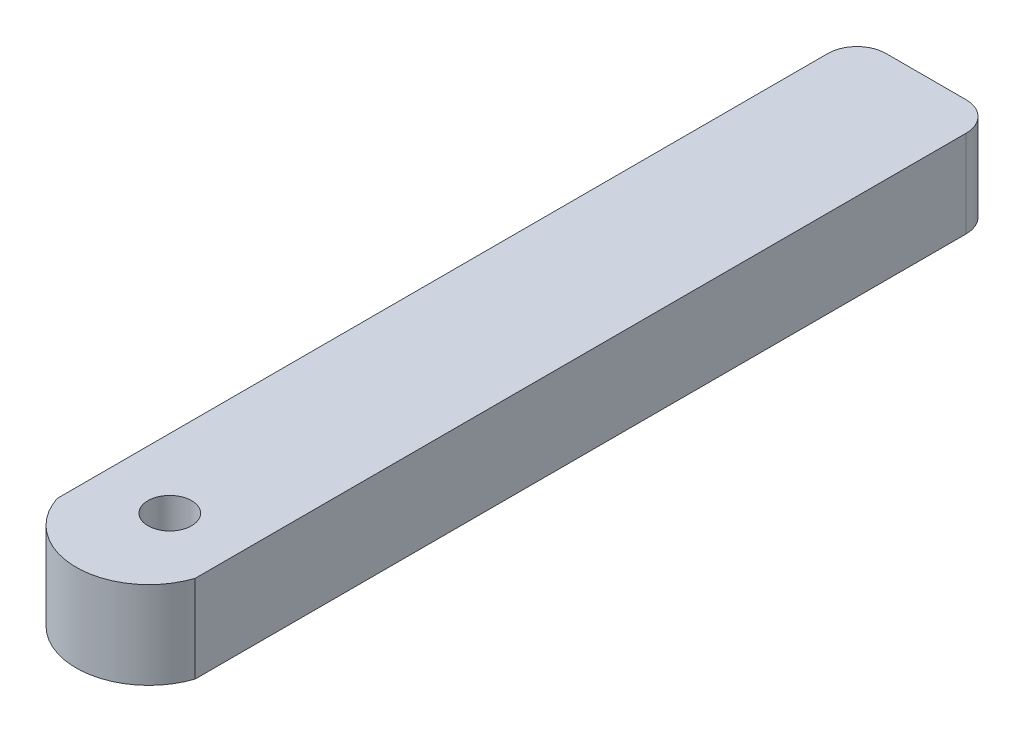
ISO-10303-21;
HEADER;
FILE_DESCRIPTION(('STEP AP214'),'2;1');
FILE_NAME('part.step','',(''),(''),'','','');
FILE_SCHEMA(('AUTOMOTIVE_DESIGN { 1 0 10303 214 1 1 1 1 }'));
ENDSEC;
DATA;
#1=APPLICATION_CONTEXT('core data for automotive mechanical design processes');
#2=APPLICATION_PROTOCOL_DEFINITION('international standard','automotive_design',2000,#1);
#3=PRODUCT_CONTEXT('',#1,'mechanical');
#4=PRODUCT('Part','Part','',(#3));
#5=PRODUCT_RELATED_PRODUCT_CATEGORY('part','',(#4));
#6=PRODUCT_DEFINITION_FORMATION('','',#4);
#7=PRODUCT_DEFINITION_CONTEXT('part definition',#1,'design');
#8=PRODUCT_DEFINITION('design','',#6,#7);
#9=PRODUCT_DEFINITION_SHAPE('','',#8);
#10=(LENGTH_UNIT() NAMED_UNIT(*) SI_UNIT(.MILLI.,.METRE.));
#11=(NAMED_UNIT(*) PLANE_ANGLE_UNIT() SI_UNIT($,.RADIAN.));
#12=(NAMED_UNIT(*) SI_UNIT($,.STERADIAN.) SOLID_ANGLE_UNIT());
#13=UNCERTAINTY_MEASURE_WITH_UNIT(LENGTH_MEASURE(1.E-05),#10,'distance_accuracy_value','');
#14=(GEOMETRIC_REPRESENTATION_CONTEXT(3) GLOBAL_UNCERTAINTY_ASSIGNED_CONTEXT((#13)) GLOBAL_UNIT_ASSIGNED_CONTEXT((#10,
#11,#12)) REPRESENTATION_CONTEXT('',''));
#15=CARTESIAN_POINT('',(0.,0.,0.));
#16=DIRECTION('',(0.,0.,1.));
#17=DIRECTION('',(1.,0.,0.));
#18=AXIS2_PLACEMENT_3D('',#15,#16,#17);
#19=CARTESIAN_POINT('',(0.,6.,13.4387505004004));
#20=DIRECTION('',(0.,1.,0.));
#21=DIRECTION('',(0.,0.,1.));
#22=AXIS2_PLACEMENT_3D('',#19,#20,#21);
#23=PLANE('',#22);
#24=DIRECTION('',(0.,0.,-1.));
#25=VECTOR('',#24,1.);
#26=CARTESIAN_POINT('',(4.75,6.,-40.));
#27=LINE('',#26,#25);
#28=CARTESIAN_POINT('',(4.74999999999999,6.,15.));
#29=VERTEX_POINT('',#28);
#30=CARTESIAN_POINT('',(4.75,6.,-38.));
#31=VERTEX_POINT('',#30);
#32=EDGE_CURVE('E120',#29,#31,#27,.T.);
#33=ORIENTED_EDGE('',*,*,#32,.T.);
#34=CARTESIAN_POINT('',(2.75,6.,-38.));
#35=DIRECTION('',(0.,1.,0.));
#36=DIRECTION('',(0.,0.,1.));
#37=AXIS2_PLACEMENT_3D('',#34,#35,#36);
#38=CIRCLE('',#37,2.);
#39=CARTESIAN_POINT('',(2.75,6.,-40.));
#40=VERTEX_POINT('',#39);
#41=EDGE_CURVE('E41',#31,#40,#38,.T.);
#42=ORIENTED_EDGE('',*,*,#41,.T.);
#43=DIRECTION('',(-1.,0.,0.));
#44=VECTOR('',#43,1.);
#45=CARTESIAN_POINT('',(4.75,6.,-40.));
#46=LINE('',#45,#44);
#47=CARTESIAN_POINT('',(-2.75,6.,-40.));
#48=VERTEX_POINT('',#47);
#49=EDGE_CURVE('E94',#40,#48,#46,.T.);
#50=ORIENTED_EDGE('',*,*,#49,.T.);
#51=CARTESIAN_POINT('',(-2.75,6.,-38.));
#52=DIRECTION('',(0.,1.,0.));
#53=DIRECTION('',(0.,0.,1.));
#54=AXIS2_PLACEMENT_3D('',#51,#52,#53);
#55=CIRCLE('',#54,2.);
#56=CARTESIAN_POINT('',(-4.75,6.,-38.));
#57=VERTEX_POINT('',#56);
#58=EDGE_CURVE('E48',#48,#57,#55,.T.);
#59=ORIENTED_EDGE('',*,*,#58,.T.);
#60=DIRECTION('',(0.,0.,1.));
#61=VECTOR('',#60,1.);
#62=CARTESIAN_POINT('',(-4.75,6.,-40.));
#63=LINE('',#62,#61);
#64=CARTESIAN_POINT('',(-4.74999999999999,6.,15.));
#65=VERTEX_POINT('',#64);
#66=EDGE_CURVE('E86',#57,#65,#63,.T.);
#67=ORIENTED_EDGE('',*,*,#66,.T.);
#68=CARTESIAN_POINT('',(0.,6.,13.4387505004004));
#69=DIRECTION('',(0.,1.,0.));
#70=DIRECTION('',(0.,0.,1.));
#71=AXIS2_PLACEMENT_3D('',#68,#69,#70);
#72=CIRCLE('',#71,5.);
#73=EDGE_CURVE('E90',#65,#29,#72,.T.);
#74=ORIENTED_EDGE('',*,*,#73,.T.);
#75=EDGE_LOOP('',(#33,#42,#50,#59,#67,#74));
#76=FACE_BOUND('',#75,.T.);
#77=CARTESIAN_POINT('',(0.,6.,12.));
#78=DIRECTION('',(0.,1.,0.));
#79=DIRECTION('',(0.,0.,1.));
#80=AXIS2_PLACEMENT_3D('',#77,#78,#79);
#81=CIRCLE('',#80,1.5);
#82=CARTESIAN_POINT('',(0.,6.,13.5));
#83=VERTEX_POINT('',#82);
#84=EDGE_CURVE('E115',#83,#83,#81,.T.);
#85=ORIENTED_EDGE('',*,*,#84,.F.);
#86=EDGE_LOOP('',(#85));
#87=FACE_BOUND('',#86,.T.);
#88=ADVANCED_FACE('F33',(#76,#87),#23,.T.);
#89=CARTESIAN_POINT('',(0.,0.,13.4387505004004));
#90=DIRECTION('',(0.,1.,0.));
#91=DIRECTION('',(0.,0.,1.));
#92=AXIS2_PLACEMENT_3D('',#89,#90,#91);
#93=PLANE('',#92);
#94=DIRECTION('',(-1.,0.,0.));
#95=VECTOR('',#94,1.);
#96=CARTESIAN_POINT('',(4.75,0.,-40.));
#97=LINE('',#96,#95);
#98=CARTESIAN_POINT('',(2.75,0.,-40.));
#99=VERTEX_POINT('',#98);
#100=CARTESIAN_POINT('',(-2.75,0.,-40.));
#101=VERTEX_POINT('',#100);
#102=EDGE_CURVE('E114',#99,#101,#97,.T.);
#103=ORIENTED_EDGE('',*,*,#102,.F.);
#104=CARTESIAN_POINT('',(2.75,0.,-38.));
#105=DIRECTION('',(0.,1.,0.));
#106=DIRECTION('',(0.,0.,1.));
#107=AXIS2_PLACEMENT_3D('',#104,#105,#106);
#108=CIRCLE('',#107,2.);
#109=CARTESIAN_POINT('',(4.75,0.,-38.));
#110=VERTEX_POINT('',#109);
#111=EDGE_CURVE('E128',#99,#110,#108,.F.);
#112=ORIENTED_EDGE('',*,*,#111,.T.);
#113=DIRECTION('',(0.,0.,-1.));
#114=VECTOR('',#113,1.);
#115=CARTESIAN_POINT('',(4.75,0.,-40.));
#116=LINE('',#115,#114);
#117=CARTESIAN_POINT('',(4.74999999999999,0.,15.));
#118=VERTEX_POINT('',#117);
#119=EDGE_CURVE('E112',#118,#110,#116,.T.);
#120=ORIENTED_EDGE('',*,*,#119,.F.);
#121=CARTESIAN_POINT('',(0.,0.,13.4387505004004));
#122=DIRECTION('',(0.,1.,0.));
#123=DIRECTION('',(0.,0.,1.));
#124=AXIS2_PLACEMENT_3D('',#121,#122,#123);
#125=CIRCLE('',#124,5.);
#126=CARTESIAN_POINT('',(-4.74999999999999,0.,15.));
#127=VERTEX_POINT('',#126);
#128=EDGE_CURVE('E119',#127,#118,#125,.T.);
#129=ORIENTED_EDGE('',*,*,#128,.F.);
#130=DIRECTION('',(0.,0.,1.));
#131=VECTOR('',#130,1.);
#132=CARTESIAN_POINT('',(-4.75,0.,-40.));
#133=LINE('',#132,#131);
#134=CARTESIAN_POINT('',(-4.75,0.,-38.));
#135=VERTEX_POINT('',#134);
#136=EDGE_CURVE('E100',#135,#127,#133,.T.);
#137=ORIENTED_EDGE('',*,*,#136,.F.);
#138=CARTESIAN_POINT('',(-2.75,0.,-38.));
#139=DIRECTION('',(0.,1.,0.));
#140=DIRECTION('',(0.,0.,1.));
#141=AXIS2_PLACEMENT_3D('',#138,#139,#140);
#142=CIRCLE('',#141,2.);
#143=EDGE_CURVE('E126',#135,#101,#142,.F.);
#144=ORIENTED_EDGE('',*,*,#143,.T.);
#145=EDGE_LOOP('',(#103,#112,#120,#129,#137,#144));
#146=FACE_BOUND('',#145,.T.);
#147=CARTESIAN_POINT('',(0.,0.,12.));
#148=DIRECTION('',(0.,1.,0.));
#149=DIRECTION('',(0.,0.,1.));
#150=AXIS2_PLACEMENT_3D('',#147,#148,#149);
#151=CIRCLE('',#150,1.5);
#152=CARTESIAN_POINT('',(0.,0.,13.5));
#153=VERTEX_POINT('',#152);
#154=EDGE_CURVE('E147',#153,#153,#151,.T.);
#155=ORIENTED_EDGE('',*,*,#154,.T.);
#156=EDGE_LOOP('',(#155));
#157=FACE_BOUND('',#156,.T.);
#158=ADVANCED_FACE('F142',(#146,#157),#93,.F.);
#159=CARTESIAN_POINT('',(4.75,6.,-40.));
#160=DIRECTION('',(-1.,0.,0.));
#161=DIRECTION('',(0.,0.,1.));
#162=AXIS2_PLACEMENT_3D('',#159,#160,#161);
#163=PLANE('',#162);
#164=ORIENTED_EDGE('',*,*,#119,.T.);
#165=DIRECTION('',(0.,-1.,0.));
#166=VECTOR('',#165,1.);
#167=CARTESIAN_POINT('',(4.75,6.,-38.));
#168=LINE('',#167,#166);
#169=EDGE_CURVE('E56',#110,#31,#168,.F.);
#170=ORIENTED_EDGE('',*,*,#169,.T.);
#171=ORIENTED_EDGE('',*,*,#32,.F.);
#172=DIRECTION('',(0.,-1.,0.));
#173=VECTOR('',#172,1.);
#174=CARTESIAN_POINT('',(4.74999999999999,6.,15.));
#175=LINE('',#174,#173);
#176=EDGE_CURVE('E104',#29,#118,#175,.T.);
#177=ORIENTED_EDGE('',*,*,#176,.T.);
#178=EDGE_LOOP('',(#164,#170,#171,#177));
#179=FACE_BOUND('',#178,.T.);
#180=ADVANCED_FACE('F144',(#179),#163,.F.);
#181=CARTESIAN_POINT('',(4.75,6.,-40.));
#182=DIRECTION('',(0.,0.,1.));
#183=DIRECTION('',(1.,0.,0.));
#184=AXIS2_PLACEMENT_3D('',#181,#182,#183);
#185=PLANE('',#184);
#186=ORIENTED_EDGE('',*,*,#49,.F.);
#187=DIRECTION('',(0.,-1.,0.));
#188=VECTOR('',#187,1.);
#189=CARTESIAN_POINT('',(2.75,6.,-40.));
#190=LINE('',#189,#188);
#191=EDGE_CURVE('E123',#40,#99,#190,.T.);
#192=ORIENTED_EDGE('',*,*,#191,.T.);
#193=ORIENTED_EDGE('',*,*,#102,.T.);
#194=DIRECTION('',(0.,-1.,0.));
#195=VECTOR('',#194,1.);
#196=CARTESIAN_POINT('',(-2.75,6.,-40.));
#197=LINE('',#196,#195);
#198=EDGE_CURVE('E103',#101,#48,#197,.F.);
#199=ORIENTED_EDGE('',*,*,#198,.T.);
#200=EDGE_LOOP('',(#186,#192,#193,#199));
#201=FACE_BOUND('',#200,.T.);
#202=ADVANCED_FACE('F136',(#201),#185,.F.);
#203=CARTESIAN_POINT('',(-4.75,6.,-40.));
#204=DIRECTION('',(1.,0.,0.));
#205=DIRECTION('',(0.,0.,-1.));
#206=AXIS2_PLACEMENT_3D('',#203,#204,#205);
#207=PLANE('',#206);
#208=ORIENTED_EDGE('',*,*,#66,.F.);
#209=DIRECTION('',(0.,-1.,0.));
#210=VECTOR('',#209,1.);
#211=CARTESIAN_POINT('',(-4.75,6.,-38.));
#212=LINE('',#211,#210);
#213=EDGE_CURVE('E11',#57,#135,#212,.T.);
#214=ORIENTED_EDGE('',*,*,#213,.T.);
#215=ORIENTED_EDGE('',*,*,#136,.T.);
#216=DIRECTION('',(0.,-1.,0.));
#217=VECTOR('',#216,1.);
#218=CARTESIAN_POINT('',(-4.74999999999999,6.,15.));
#219=LINE('',#218,#217);
#220=EDGE_CURVE('E97',#65,#127,#219,.T.);
#221=ORIENTED_EDGE('',*,*,#220,.F.);
#222=EDGE_LOOP('',(#208,#214,#215,#221));
#223=FACE_BOUND('',#222,.T.);
#224=ADVANCED_FACE('F98',(#223),#207,.F.);
#225=CARTESIAN_POINT('',(0.,6.,13.4387505004004));
#226=DIRECTION('',(0.,-1.,0.));
#227=DIRECTION('',(0.,0.,-1.));
#228=AXIS2_PLACEMENT_3D('',#225,#226,#227);
#229=CYLINDRICAL_SURFACE('',#228,5.);
#230=ORIENTED_EDGE('',*,*,#128,.T.);
#231=ORIENTED_EDGE('',*,*,#176,.F.);
#232=ORIENTED_EDGE('',*,*,#73,.F.);
#233=ORIENTED_EDGE('',*,*,#220,.T.);
#234=EDGE_LOOP('',(#230,#231,#232,#233));
#235=FACE_BOUND('',#234,.T.);
#236=ADVANCED_FACE('F106',(#235),#229,.T.);
#237=CARTESIAN_POINT('',(0.,6.,12.));
#238=DIRECTION('',(0.,-1.,0.));
#239=DIRECTION('',(0.,0.,-1.));
#240=AXIS2_PLACEMENT_3D('',#237,#238,#239);
#241=CYLINDRICAL_SURFACE('',#240,1.5);
#242=ORIENTED_EDGE('',*,*,#84,.T.);
#243=EDGE_LOOP('',(#242));
#244=FACE_BOUND('',#243,.T.);
#245=ORIENTED_EDGE('',*,*,#154,.F.);
#246=EDGE_LOOP('',(#245));
#247=FACE_BOUND('',#246,.T.);
#248=ADVANCED_FACE('F153',(#244,#247),#241,.F.);
#249=CARTESIAN_POINT('',(2.75,6.,-38.));
#250=DIRECTION('',(0.,-1.,0.));
#251=DIRECTION('',(0.,0.,-1.));
#252=AXIS2_PLACEMENT_3D('',#249,#250,#251);
#253=CYLINDRICAL_SURFACE('',#252,2.);
#254=ORIENTED_EDGE('',*,*,#41,.F.);
#255=ORIENTED_EDGE('',*,*,#169,.F.);
#256=ORIENTED_EDGE('',*,*,#111,.F.);
#257=ORIENTED_EDGE('',*,*,#191,.F.);
#258=EDGE_LOOP('',(#254,#255,#256,#257));
#259=FACE_BOUND('',#258,.T.);
#260=ADVANCED_FACE('F139',(#259),#253,.T.);
#261=CARTESIAN_POINT('',(-2.75,6.,-38.));
#262=DIRECTION('',(0.,-1.,0.));
#263=DIRECTION('',(0.,0.,-1.));
#264=AXIS2_PLACEMENT_3D('',#261,#262,#263);
#265=CYLINDRICAL_SURFACE('',#264,2.);
#266=ORIENTED_EDGE('',*,*,#58,.F.);
#267=ORIENTED_EDGE('',*,*,#198,.F.);
#268=ORIENTED_EDGE('',*,*,#143,.F.);
#269=ORIENTED_EDGE('',*,*,#213,.F.);
#270=EDGE_LOOP('',(#266,#267,#268,#269));
#271=FACE_BOUND('',#270,.T.);
#272=ADVANCED_FACE('F35',(#271),#265,.T.);
#273=CLOSED_SHELL('',(#88,#158,#180,#202,#224,#236,#248,#260,#272));
#274=MANIFOLD_SOLID_BREP('B2',#273);
#275=ADVANCED_BREP_SHAPE_REPRESENTATION('',(#18,#274),#14);
#276=SHAPE_DEFINITION_REPRESENTATION(#9,#275);
ENDSEC;
END-ISO-10303-21;
